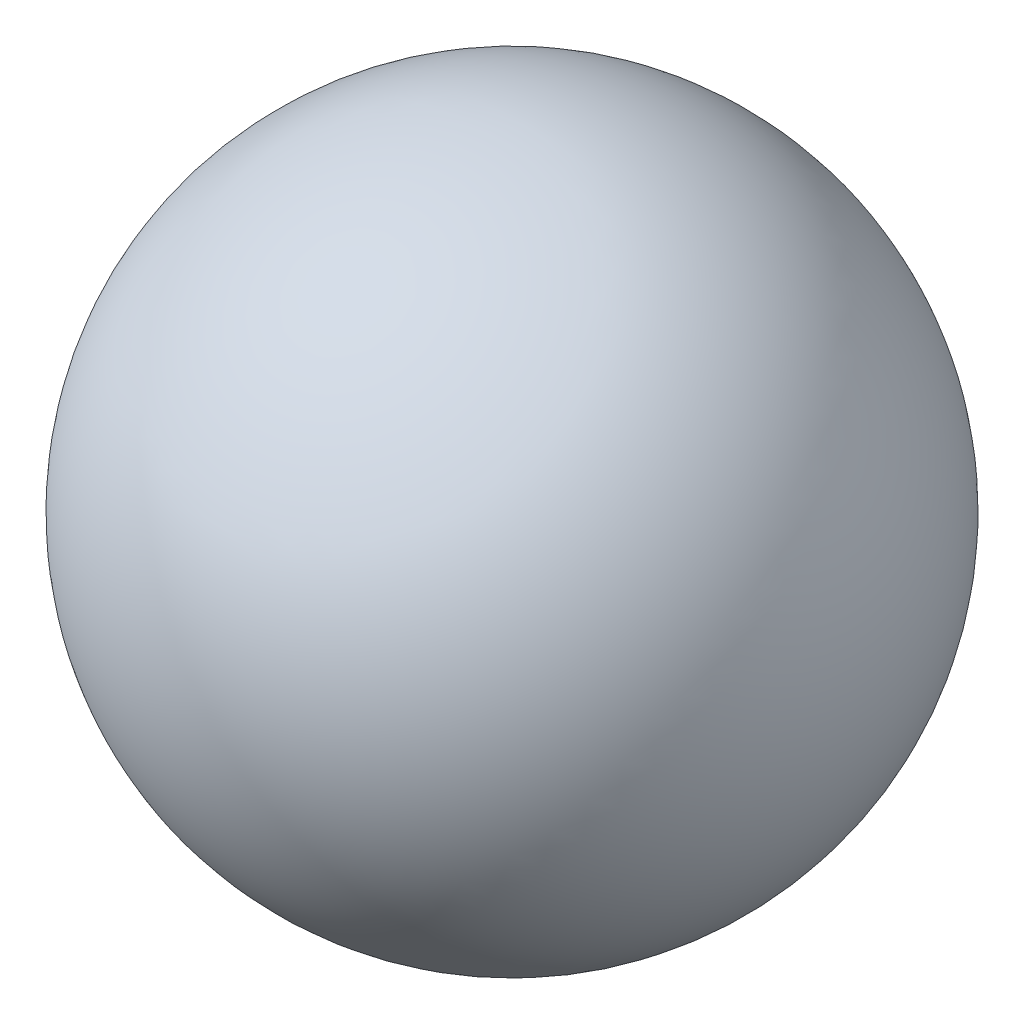
ISO-10303-21;
HEADER;
FILE_DESCRIPTION(('STEP AP214'),'2;1');
FILE_NAME('part.step','',(''),(''),'','','');
FILE_SCHEMA(('AUTOMOTIVE_DESIGN { 1 0 10303 214 1 1 1 1 }'));
ENDSEC;
DATA;
#1=APPLICATION_CONTEXT('core data for automotive mechanical design processes');
#2=APPLICATION_PROTOCOL_DEFINITION('international standard','automotive_design',2000,#1);
#3=PRODUCT_CONTEXT('',#1,'mechanical');
#4=PRODUCT('Part','Part','',(#3));
#5=PRODUCT_RELATED_PRODUCT_CATEGORY('part','',(#4));
#6=PRODUCT_DEFINITION_FORMATION('','',#4);
#7=PRODUCT_DEFINITION_CONTEXT('part definition',#1,'design');
#8=PRODUCT_DEFINITION('design','',#6,#7);
#9=PRODUCT_DEFINITION_SHAPE('','',#8);
#10=(LENGTH_UNIT() NAMED_UNIT(*) SI_UNIT(.MILLI.,.METRE.));
#11=(NAMED_UNIT(*) PLANE_ANGLE_UNIT() SI_UNIT($,.RADIAN.));
#12=(NAMED_UNIT(*) SI_UNIT($,.STERADIAN.) SOLID_ANGLE_UNIT());
#13=UNCERTAINTY_MEASURE_WITH_UNIT(LENGTH_MEASURE(1.E-05),#10,'distance_accuracy_value','');
#14=(GEOMETRIC_REPRESENTATION_CONTEXT(3) GLOBAL_UNCERTAINTY_ASSIGNED_CONTEXT((#13)) GLOBAL_UNIT_ASSIGNED_CONTEXT((#10,
#11,#12)) REPRESENTATION_CONTEXT('',''));
#15=CARTESIAN_POINT('',(0.,0.,0.));
#16=DIRECTION('',(0.,0.,1.));
#17=DIRECTION('',(1.,0.,0.));
#18=AXIS2_PLACEMENT_3D('',#15,#16,#17);
#19=CARTESIAN_POINT('',(5.38416163029708,-2.,-10.4438165216953));
#20=DIRECTION('',(0.,0.,1.));
#21=DIRECTION('',(1.,0.,0.));
#22=AXIS2_PLACEMENT_3D('',#19,#20,#21);
#23=SPHERICAL_SURFACE('',#22,1.05);
#24=CARTESIAN_POINT('',(5.38416163029708,-2.,-9.3938165216953));
#25=VERTEX_POINT('',#24);
#26=VERTEX_LOOP('',#25);
#27=FACE_BOUND('',#26,.T.);
#28=ADVANCED_FACE('F13',(#27),#23,.T.);
#29=CLOSED_SHELL('',(#28));
#30=MANIFOLD_SOLID_BREP('B1',#29);
#31=ADVANCED_BREP_SHAPE_REPRESENTATION('',(#18,#30),#14);
#32=SHAPE_DEFINITION_REPRESENTATION(#9,#31);
ENDSEC;
END-ISO-10303-21;
